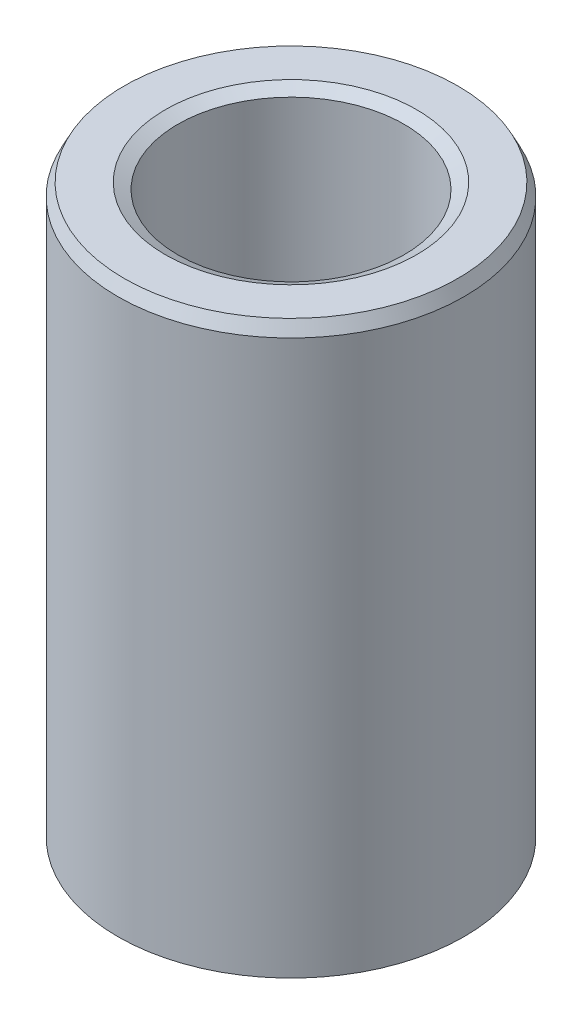
ISO-10303-21;
HEADER;
FILE_DESCRIPTION(('STEP AP214'),'2;1');
FILE_NAME('part.step','',(''),(''),'','','');
FILE_SCHEMA(('AUTOMOTIVE_DESIGN { 1 0 10303 214 1 1 1 1 }'));
ENDSEC;
DATA;
#1=APPLICATION_CONTEXT('core data for automotive mechanical design processes');
#2=APPLICATION_PROTOCOL_DEFINITION('international standard','automotive_design',2000,#1);
#3=PRODUCT_CONTEXT('',#1,'mechanical');
#4=PRODUCT('Part','Part','',(#3));
#5=PRODUCT_RELATED_PRODUCT_CATEGORY('part','',(#4));
#6=PRODUCT_DEFINITION_FORMATION('','',#4);
#7=PRODUCT_DEFINITION_CONTEXT('part definition',#1,'design');
#8=PRODUCT_DEFINITION('design','',#6,#7);
#9=PRODUCT_DEFINITION_SHAPE('','',#8);
#10=(LENGTH_UNIT() NAMED_UNIT(*) SI_UNIT(.MILLI.,.METRE.));
#11=(NAMED_UNIT(*) PLANE_ANGLE_UNIT() SI_UNIT($,.RADIAN.));
#12=(NAMED_UNIT(*) SI_UNIT($,.STERADIAN.) SOLID_ANGLE_UNIT());
#13=UNCERTAINTY_MEASURE_WITH_UNIT(LENGTH_MEASURE(1.E-05),#10,'distance_accuracy_value','');
#14=(GEOMETRIC_REPRESENTATION_CONTEXT(3) GLOBAL_UNCERTAINTY_ASSIGNED_CONTEXT((#13)) GLOBAL_UNIT_ASSIGNED_CONTEXT((#10,
#11,#12)) REPRESENTATION_CONTEXT('',''));
#15=CARTESIAN_POINT('',(0.,0.,0.));
#16=DIRECTION('',(0.,0.,1.));
#17=DIRECTION('',(1.,0.,0.));
#18=AXIS2_PLACEMENT_3D('',#15,#16,#17);
#19=CARTESIAN_POINT('',(0.,115.841860667489,0.));
#20=DIRECTION('',(0.,-1.,0.));
#21=DIRECTION('',(0.,0.,-1.));
#22=AXIS2_PLACEMENT_3D('',#19,#20,#21);
#23=CYLINDRICAL_SURFACE('',#22,35.);
#24=CARTESIAN_POINT('',(0.,1.28381789845461,0.));
#25=DIRECTION('',(0.,1.,0.));
#26=DIRECTION('',(0.,0.,1.));
#27=AXIS2_PLACEMENT_3D('',#24,#25,#26);
#28=CIRCLE('',#27,35.);
#29=CARTESIAN_POINT('',(0.,1.28381789845461,35.));
#30=VERTEX_POINT('',#29);
#31=EDGE_CURVE('E10',#30,#30,#28,.T.);
#32=ORIENTED_EDGE('',*,*,#31,.T.);
#33=EDGE_LOOP('',(#32));
#34=FACE_BOUND('',#33,.T.);
#35=CARTESIAN_POINT('',(0.,113.308355743638,0.));
#36=DIRECTION('',(0.,1.,0.));
#37=DIRECTION('',(0.,0.,1.));
#38=AXIS2_PLACEMENT_3D('',#35,#36,#37);
#39=CIRCLE('',#38,35.);
#40=CARTESIAN_POINT('',(0.,113.308355743638,35.));
#41=VERTEX_POINT('',#40);
#42=EDGE_CURVE('E50',#41,#41,#39,.F.);
#43=ORIENTED_EDGE('',*,*,#42,.T.);
#44=EDGE_LOOP('',(#43));
#45=FACE_BOUND('',#44,.T.);
#46=ADVANCED_FACE('F39',(#34,#45),#23,.T.);
#47=CARTESIAN_POINT('',(0.,115.841860667489,0.));
#48=DIRECTION('',(0.,1.,0.));
#49=DIRECTION('',(0.,0.,1.));
#50=AXIS2_PLACEMENT_3D('',#47,#48,#49);
#51=PLANE('',#50);
#52=CARTESIAN_POINT('',(0.,115.841860667489,0.));
#53=DIRECTION('',(0.,1.,0.));
#54=DIRECTION('',(0.,0.,1.));
#55=AXIS2_PLACEMENT_3D('',#52,#53,#54);
#56=CIRCLE('',#55,25.4020723979996);
#57=CARTESIAN_POINT('',(0.,115.841860667489,25.4020723979996));
#58=VERTEX_POINT('',#57);
#59=EDGE_CURVE('E58',#58,#58,#56,.F.);
#60=ORIENTED_EDGE('',*,*,#59,.T.);
#61=EDGE_LOOP('',(#60));
#62=FACE_BOUND('',#61,.T.);
#63=CARTESIAN_POINT('',(0.,115.841860667489,0.));
#64=DIRECTION('',(0.,1.,0.));
#65=DIRECTION('',(0.,0.,1.));
#66=AXIS2_PLACEMENT_3D('',#63,#64,#65);
#67=CIRCLE('',#66,33.7161821015454);
#68=CARTESIAN_POINT('',(0.,115.841860667489,33.7161821015454));
#69=VERTEX_POINT('',#68);
#70=EDGE_CURVE('E61',#69,#69,#67,.T.);
#71=ORIENTED_EDGE('',*,*,#70,.T.);
#72=EDGE_LOOP('',(#71));
#73=FACE_BOUND('',#72,.T.);
#74=ADVANCED_FACE('F88',(#62,#73),#51,.T.);
#75=CARTESIAN_POINT('',(0.,0.,0.));
#76=DIRECTION('',(0.,1.,0.));
#77=DIRECTION('',(0.,0.,1.));
#78=AXIS2_PLACEMENT_3D('',#75,#76,#77);
#79=PLANE('',#78);
#80=CARTESIAN_POINT('',(0.,0.,0.));
#81=DIRECTION('',(0.,1.,0.));
#82=DIRECTION('',(0.,0.,1.));
#83=AXIS2_PLACEMENT_3D('',#80,#81,#82);
#84=CIRCLE('',#83,24.1523853726029);
#85=CARTESIAN_POINT('',(0.,0.,24.1523853726029));
#86=VERTEX_POINT('',#85);
#87=EDGE_CURVE('E51',#86,#86,#84,.T.);
#88=ORIENTED_EDGE('',*,*,#87,.T.);
#89=EDGE_LOOP('',(#88));
#90=FACE_BOUND('',#89,.T.);
#91=CARTESIAN_POINT('',(0.,0.,0.));
#92=DIRECTION('',(0.,1.,0.));
#93=DIRECTION('',(0.,0.,1.));
#94=AXIS2_PLACEMENT_3D('',#91,#92,#93);
#95=CIRCLE('',#94,32.4664950761486);
#96=CARTESIAN_POINT('',(0.,0.,32.4664950761486));
#97=VERTEX_POINT('',#96);
#98=EDGE_CURVE('E54',#97,#97,#95,.F.);
#99=ORIENTED_EDGE('',*,*,#98,.T.);
#100=EDGE_LOOP('',(#99));
#101=FACE_BOUND('',#100,.T.);
#102=ADVANCED_FACE('F83',(#90,#101),#79,.F.);
#103=CARTESIAN_POINT('',(0.,115.841860667489,0.));
#104=DIRECTION('',(0.,-1.,0.));
#105=DIRECTION('',(0.,0.,-1.));
#106=AXIS2_PLACEMENT_3D('',#103,#104,#105);
#107=CYLINDRICAL_SURFACE('',#106,22.8685674741483);
#108=CARTESIAN_POINT('',(0.,114.558042769034,0.));
#109=DIRECTION('',(0.,1.,0.));
#110=DIRECTION('',(0.,0.,1.));
#111=AXIS2_PLACEMENT_3D('',#108,#109,#110);
#112=CIRCLE('',#111,22.8685674741483);
#113=CARTESIAN_POINT('',(0.,114.558042769034,22.8685674741483));
#114=VERTEX_POINT('',#113);
#115=EDGE_CURVE('E67',#114,#114,#112,.T.);
#116=ORIENTED_EDGE('',*,*,#115,.T.);
#117=EDGE_LOOP('',(#116));
#118=FACE_BOUND('',#117,.T.);
#119=CARTESIAN_POINT('',(0.,2.53350492385128,0.));
#120=DIRECTION('',(0.,1.,0.));
#121=DIRECTION('',(0.,0.,1.));
#122=AXIS2_PLACEMENT_3D('',#119,#120,#121);
#123=CIRCLE('',#122,22.8685674741483);
#124=CARTESIAN_POINT('',(0.,2.53350492385128,22.8685674741483));
#125=VERTEX_POINT('',#124);
#126=EDGE_CURVE('E69',#125,#125,#123,.F.);
#127=ORIENTED_EDGE('',*,*,#126,.T.);
#128=EDGE_LOOP('',(#127));
#129=FACE_BOUND('',#128,.T.);
#130=ADVANCED_FACE('F71',(#118,#129),#107,.F.);
#131=CARTESIAN_POINT('',(0.,114.558042769034,0.));
#132=DIRECTION('',(0.,1.,0.));
#133=DIRECTION('',(0.,0.,1.));
#134=AXIS2_PLACEMENT_3D('',#131,#132,#133);
#135=CONICAL_SURFACE('',#134,22.8685674741483,1.10177452944679);
#136=ORIENTED_EDGE('',*,*,#59,.F.);
#137=EDGE_LOOP('',(#136));
#138=FACE_BOUND('',#137,.T.);
#139=ORIENTED_EDGE('',*,*,#115,.F.);
#140=EDGE_LOOP('',(#139));
#141=FACE_BOUND('',#140,.T.);
#142=ADVANCED_FACE('F77',(#138,#141),#135,.F.);
#143=CARTESIAN_POINT('',(0.,0.,0.));
#144=DIRECTION('',(0.,-1.,0.));
#145=DIRECTION('',(0.,0.,-1.));
#146=AXIS2_PLACEMENT_3D('',#143,#144,#145);
#147=CONICAL_SURFACE('',#146,24.1523853726029,0.469021797348099);
#148=ORIENTED_EDGE('',*,*,#126,.F.);
#149=EDGE_LOOP('',(#148));
#150=FACE_BOUND('',#149,.T.);
#151=ORIENTED_EDGE('',*,*,#87,.F.);
#152=EDGE_LOOP('',(#151));
#153=FACE_BOUND('',#152,.T.);
#154=ADVANCED_FACE('F73',(#150,#153),#147,.F.);
#155=CARTESIAN_POINT('',(0.,1.28381789845461,0.));
#156=DIRECTION('',(0.,1.,0.));
#157=DIRECTION('',(0.,0.,1.));
#158=AXIS2_PLACEMENT_3D('',#155,#156,#157);
#159=CONICAL_SURFACE('',#158,35.,1.1017745294468);
#160=ORIENTED_EDGE('',*,*,#98,.F.);
#161=EDGE_LOOP('',(#160));
#162=FACE_BOUND('',#161,.T.);
#163=ORIENTED_EDGE('',*,*,#31,.F.);
#164=EDGE_LOOP('',(#163));
#165=FACE_BOUND('',#164,.T.);
#166=ADVANCED_FACE('F76',(#162,#165),#159,.T.);
#167=CARTESIAN_POINT('',(0.,115.841860667489,0.));
#168=DIRECTION('',(0.,-1.,0.));
#169=DIRECTION('',(0.,0.,-1.));
#170=AXIS2_PLACEMENT_3D('',#167,#168,#169);
#171=CONICAL_SURFACE('',#170,33.7161821015454,0.469021797348099);
#172=ORIENTED_EDGE('',*,*,#42,.F.);
#173=EDGE_LOOP('',(#172));
#174=FACE_BOUND('',#173,.T.);
#175=ORIENTED_EDGE('',*,*,#70,.F.);
#176=EDGE_LOOP('',(#175));
#177=FACE_BOUND('',#176,.T.);
#178=ADVANCED_FACE('F45',(#174,#177),#171,.T.);
#179=CLOSED_SHELL('',(#46,#74,#102,#130,#142,#154,#166,#178));
#180=MANIFOLD_SOLID_BREP('B2',#179);
#181=ADVANCED_BREP_SHAPE_REPRESENTATION('',(#18,#180),#14);
#182=SHAPE_DEFINITION_REPRESENTATION(#9,#181);
ENDSEC;
END-ISO-10303-21;
